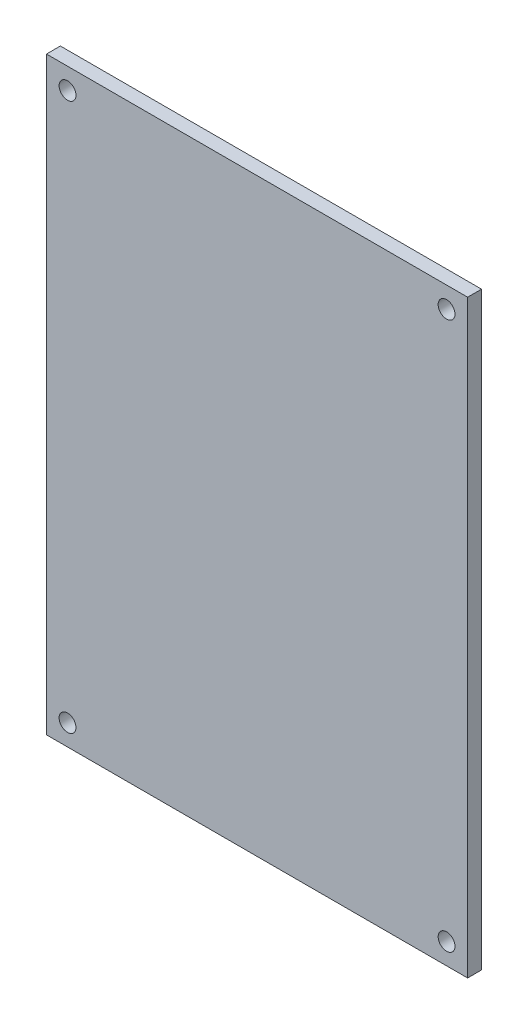
ISO-10303-21;
HEADER;
FILE_DESCRIPTION(('STEP AP214'),'2;1');
FILE_NAME('part.step','',(''),(''),'','','');
FILE_SCHEMA(('AUTOMOTIVE_DESIGN { 1 0 10303 214 1 1 1 1 }'));
ENDSEC;
DATA;
#1=APPLICATION_CONTEXT('core data for automotive mechanical design processes');
#2=APPLICATION_PROTOCOL_DEFINITION('international standard','automotive_design',2000,#1);
#3=PRODUCT_CONTEXT('',#1,'mechanical');
#4=PRODUCT('Part','Part','',(#3));
#5=PRODUCT_RELATED_PRODUCT_CATEGORY('part','',(#4));
#6=PRODUCT_DEFINITION_FORMATION('','',#4);
#7=PRODUCT_DEFINITION_CONTEXT('part definition',#1,'design');
#8=PRODUCT_DEFINITION('design','',#6,#7);
#9=PRODUCT_DEFINITION_SHAPE('','',#8);
#10=(LENGTH_UNIT() NAMED_UNIT(*) SI_UNIT(.MILLI.,.METRE.));
#11=(NAMED_UNIT(*) PLANE_ANGLE_UNIT() SI_UNIT($,.RADIAN.));
#12=(NAMED_UNIT(*) SI_UNIT($,.STERADIAN.) SOLID_ANGLE_UNIT());
#13=UNCERTAINTY_MEASURE_WITH_UNIT(LENGTH_MEASURE(1.E-05),#10,'distance_accuracy_value','');
#14=(GEOMETRIC_REPRESENTATION_CONTEXT(3) GLOBAL_UNCERTAINTY_ASSIGNED_CONTEXT((#13)) GLOBAL_UNIT_ASSIGNED_CONTEXT((#10,
#11,#12)) REPRESENTATION_CONTEXT('',''));
#15=CARTESIAN_POINT('',(0.,0.,0.));
#16=DIRECTION('',(0.,0.,1.));
#17=DIRECTION('',(1.,0.,0.));
#18=AXIS2_PLACEMENT_3D('',#15,#16,#17);
#19=CARTESIAN_POINT('',(0.,0.,1.65));
#20=DIRECTION('',(0.,0.,1.));
#21=DIRECTION('',(1.,0.,0.));
#22=AXIS2_PLACEMENT_3D('',#19,#20,#21);
#23=PLANE('',#22);
#24=CARTESIAN_POINT('',(22.5,-32.5,1.65));
#25=DIRECTION('',(0.,0.,1.));
#26=DIRECTION('',(1.,0.,0.));
#27=AXIS2_PLACEMENT_3D('',#24,#25,#26);
#28=CIRCLE('',#27,0.999999999999998);
#29=CARTESIAN_POINT('',(23.5,-32.5,1.65));
#30=VERTEX_POINT('',#29);
#31=EDGE_CURVE('E124',#30,#30,#28,.T.);
#32=ORIENTED_EDGE('',*,*,#31,.F.);
#33=EDGE_LOOP('',(#32));
#34=FACE_BOUND('',#33,.T.);
#35=CARTESIAN_POINT('',(-22.5,32.5,1.65));
#36=DIRECTION('',(0.,0.,1.));
#37=DIRECTION('',(1.,0.,0.));
#38=AXIS2_PLACEMENT_3D('',#35,#36,#37);
#39=CIRCLE('',#38,1.);
#40=CARTESIAN_POINT('',(-21.5,32.5,1.65));
#41=VERTEX_POINT('',#40);
#42=EDGE_CURVE('E103',#41,#41,#39,.T.);
#43=ORIENTED_EDGE('',*,*,#42,.F.);
#44=EDGE_LOOP('',(#43));
#45=FACE_BOUND('',#44,.T.);
#46=DIRECTION('',(0.,1.,0.));
#47=VECTOR('',#46,1.);
#48=CARTESIAN_POINT('',(25.,35.,1.65));
#49=LINE('',#48,#47);
#50=CARTESIAN_POINT('',(25.,-35.,1.65));
#51=VERTEX_POINT('',#50);
#52=CARTESIAN_POINT('',(25.,35.,1.65));
#53=VERTEX_POINT('',#52);
#54=EDGE_CURVE('E88',#51,#53,#49,.T.);
#55=ORIENTED_EDGE('',*,*,#54,.T.);
#56=DIRECTION('',(-1.,0.,0.));
#57=VECTOR('',#56,1.);
#58=CARTESIAN_POINT('',(-25.,35.,1.65));
#59=LINE('',#58,#57);
#60=CARTESIAN_POINT('',(-25.,35.,1.65));
#61=VERTEX_POINT('',#60);
#62=EDGE_CURVE('E83',#53,#61,#59,.T.);
#63=ORIENTED_EDGE('',*,*,#62,.T.);
#64=DIRECTION('',(0.,-1.,0.));
#65=VECTOR('',#64,1.);
#66=CARTESIAN_POINT('',(-25.,35.,1.65));
#67=LINE('',#66,#65);
#68=CARTESIAN_POINT('',(-25.,-35.,1.65));
#69=VERTEX_POINT('',#68);
#70=EDGE_CURVE('E86',#61,#69,#67,.T.);
#71=ORIENTED_EDGE('',*,*,#70,.T.);
#72=DIRECTION('',(1.,0.,0.));
#73=VECTOR('',#72,1.);
#74=CARTESIAN_POINT('',(-25.,-35.,1.65));
#75=LINE('',#74,#73);
#76=EDGE_CURVE('E53',#69,#51,#75,.T.);
#77=ORIENTED_EDGE('',*,*,#76,.T.);
#78=EDGE_LOOP('',(#55,#63,#71,#77));
#79=FACE_BOUND('',#78,.T.);
#80=CARTESIAN_POINT('',(22.5,32.5,1.65));
#81=DIRECTION('',(0.,0.,1.));
#82=DIRECTION('',(1.,0.,0.));
#83=AXIS2_PLACEMENT_3D('',#80,#81,#82);
#84=CIRCLE('',#83,1.);
#85=CARTESIAN_POINT('',(23.5,32.5,1.65));
#86=VERTEX_POINT('',#85);
#87=EDGE_CURVE('E118',#86,#86,#84,.T.);
#88=ORIENTED_EDGE('',*,*,#87,.F.);
#89=EDGE_LOOP('',(#88));
#90=FACE_BOUND('',#89,.T.);
#91=CARTESIAN_POINT('',(-22.5,-32.5,1.65));
#92=DIRECTION('',(0.,0.,1.));
#93=DIRECTION('',(1.,0.,0.));
#94=AXIS2_PLACEMENT_3D('',#91,#92,#93);
#95=CIRCLE('',#94,1.);
#96=CARTESIAN_POINT('',(-21.5,-32.5,1.65));
#97=VERTEX_POINT('',#96);
#98=EDGE_CURVE('E130',#97,#97,#95,.T.);
#99=ORIENTED_EDGE('',*,*,#98,.F.);
#100=EDGE_LOOP('',(#99));
#101=FACE_BOUND('',#100,.T.);
#102=ADVANCED_FACE('F36',(#34,#45,#79,#90,#101),#23,.T.);
#103=CARTESIAN_POINT('',(0.,0.,0.));
#104=DIRECTION('',(0.,0.,1.));
#105=DIRECTION('',(1.,0.,0.));
#106=AXIS2_PLACEMENT_3D('',#103,#104,#105);
#107=PLANE('',#106);
#108=DIRECTION('',(0.,1.,0.));
#109=VECTOR('',#108,1.);
#110=CARTESIAN_POINT('',(25.,35.,0.));
#111=LINE('',#110,#109);
#112=CARTESIAN_POINT('',(25.,-35.,0.));
#113=VERTEX_POINT('',#112);
#114=CARTESIAN_POINT('',(25.,35.,0.));
#115=VERTEX_POINT('',#114);
#116=EDGE_CURVE('E100',#113,#115,#111,.T.);
#117=ORIENTED_EDGE('',*,*,#116,.F.);
#118=DIRECTION('',(1.,0.,0.));
#119=VECTOR('',#118,1.);
#120=CARTESIAN_POINT('',(-25.,-35.,0.));
#121=LINE('',#120,#119);
#122=CARTESIAN_POINT('',(-25.,-35.,0.));
#123=VERTEX_POINT('',#122);
#124=EDGE_CURVE('E76',#123,#113,#121,.T.);
#125=ORIENTED_EDGE('',*,*,#124,.F.);
#126=DIRECTION('',(0.,-1.,0.));
#127=VECTOR('',#126,1.);
#128=CARTESIAN_POINT('',(-25.,35.,0.));
#129=LINE('',#128,#127);
#130=CARTESIAN_POINT('',(-25.,35.,0.));
#131=VERTEX_POINT('',#130);
#132=EDGE_CURVE('E70',#131,#123,#129,.T.);
#133=ORIENTED_EDGE('',*,*,#132,.F.);
#134=DIRECTION('',(-1.,0.,0.));
#135=VECTOR('',#134,1.);
#136=CARTESIAN_POINT('',(-25.,35.,0.));
#137=LINE('',#136,#135);
#138=EDGE_CURVE('E92',#115,#131,#137,.T.);
#139=ORIENTED_EDGE('',*,*,#138,.F.);
#140=EDGE_LOOP('',(#117,#125,#133,#139));
#141=FACE_BOUND('',#140,.T.);
#142=CARTESIAN_POINT('',(-22.5,32.5,0.));
#143=DIRECTION('',(0.,0.,1.));
#144=DIRECTION('',(1.,0.,0.));
#145=AXIS2_PLACEMENT_3D('',#142,#143,#144);
#146=CIRCLE('',#145,1.);
#147=CARTESIAN_POINT('',(-21.5,32.5,0.));
#148=VERTEX_POINT('',#147);
#149=EDGE_CURVE('E115',#148,#148,#146,.T.);
#150=ORIENTED_EDGE('',*,*,#149,.T.);
#151=EDGE_LOOP('',(#150));
#152=FACE_BOUND('',#151,.T.);
#153=CARTESIAN_POINT('',(22.5,32.5,0.));
#154=DIRECTION('',(0.,0.,1.));
#155=DIRECTION('',(1.,0.,0.));
#156=AXIS2_PLACEMENT_3D('',#153,#154,#155);
#157=CIRCLE('',#156,1.);
#158=CARTESIAN_POINT('',(23.5,32.5,0.));
#159=VERTEX_POINT('',#158);
#160=EDGE_CURVE('E121',#159,#159,#157,.T.);
#161=ORIENTED_EDGE('',*,*,#160,.T.);
#162=EDGE_LOOP('',(#161));
#163=FACE_BOUND('',#162,.T.);
#164=CARTESIAN_POINT('',(22.5,-32.5,0.));
#165=DIRECTION('',(0.,0.,1.));
#166=DIRECTION('',(1.,0.,0.));
#167=AXIS2_PLACEMENT_3D('',#164,#165,#166);
#168=CIRCLE('',#167,0.999999999999998);
#169=CARTESIAN_POINT('',(23.5,-32.5,0.));
#170=VERTEX_POINT('',#169);
#171=EDGE_CURVE('E127',#170,#170,#168,.T.);
#172=ORIENTED_EDGE('',*,*,#171,.T.);
#173=EDGE_LOOP('',(#172));
#174=FACE_BOUND('',#173,.T.);
#175=CARTESIAN_POINT('',(-22.5,-32.5,0.));
#176=DIRECTION('',(0.,0.,1.));
#177=DIRECTION('',(1.,0.,0.));
#178=AXIS2_PLACEMENT_3D('',#175,#176,#177);
#179=CIRCLE('',#178,1.);
#180=CARTESIAN_POINT('',(-21.5,-32.5,0.));
#181=VERTEX_POINT('',#180);
#182=EDGE_CURVE('E133',#181,#181,#179,.T.);
#183=ORIENTED_EDGE('',*,*,#182,.T.);
#184=EDGE_LOOP('',(#183));
#185=FACE_BOUND('',#184,.T.);
#186=ADVANCED_FACE('F111',(#141,#152,#163,#174,#185),#107,.F.);
#187=CARTESIAN_POINT('',(25.,35.,1.65));
#188=DIRECTION('',(-1.,0.,0.));
#189=DIRECTION('',(0.,-1.,0.));
#190=AXIS2_PLACEMENT_3D('',#187,#188,#189);
#191=PLANE('',#190);
#192=ORIENTED_EDGE('',*,*,#116,.T.);
#193=DIRECTION('',(0.,0.,-1.));
#194=VECTOR('',#193,1.);
#195=CARTESIAN_POINT('',(25.,35.,1.65));
#196=LINE('',#195,#194);
#197=EDGE_CURVE('E11',#53,#115,#196,.T.);
#198=ORIENTED_EDGE('',*,*,#197,.F.);
#199=ORIENTED_EDGE('',*,*,#54,.F.);
#200=DIRECTION('',(0.,0.,-1.));
#201=VECTOR('',#200,1.);
#202=CARTESIAN_POINT('',(25.,-35.,1.65));
#203=LINE('',#202,#201);
#204=EDGE_CURVE('E96',#51,#113,#203,.T.);
#205=ORIENTED_EDGE('',*,*,#204,.T.);
#206=EDGE_LOOP('',(#192,#198,#199,#205));
#207=FACE_BOUND('',#206,.T.);
#208=ADVANCED_FACE('F38',(#207),#191,.F.);
#209=CARTESIAN_POINT('',(-25.,35.,1.65));
#210=DIRECTION('',(0.,-1.,0.));
#211=DIRECTION('',(1.,0.,0.));
#212=AXIS2_PLACEMENT_3D('',#209,#210,#211);
#213=PLANE('',#212);
#214=ORIENTED_EDGE('',*,*,#138,.T.);
#215=DIRECTION('',(0.,0.,-1.));
#216=VECTOR('',#215,1.);
#217=CARTESIAN_POINT('',(-25.,35.,1.65));
#218=LINE('',#217,#216);
#219=EDGE_CURVE('E45',#61,#131,#218,.T.);
#220=ORIENTED_EDGE('',*,*,#219,.F.);
#221=ORIENTED_EDGE('',*,*,#62,.F.);
#222=ORIENTED_EDGE('',*,*,#197,.T.);
#223=EDGE_LOOP('',(#214,#220,#221,#222));
#224=FACE_BOUND('',#223,.T.);
#225=ADVANCED_FACE('F91',(#224),#213,.F.);
#226=CARTESIAN_POINT('',(-25.,35.,1.65));
#227=DIRECTION('',(1.,0.,0.));
#228=DIRECTION('',(0.,1.,0.));
#229=AXIS2_PLACEMENT_3D('',#226,#227,#228);
#230=PLANE('',#229);
#231=ORIENTED_EDGE('',*,*,#132,.T.);
#232=DIRECTION('',(0.,0.,-1.));
#233=VECTOR('',#232,1.);
#234=CARTESIAN_POINT('',(-25.,-35.,1.65));
#235=LINE('',#234,#233);
#236=EDGE_CURVE('E93',#69,#123,#235,.T.);
#237=ORIENTED_EDGE('',*,*,#236,.F.);
#238=ORIENTED_EDGE('',*,*,#70,.F.);
#239=ORIENTED_EDGE('',*,*,#219,.T.);
#240=EDGE_LOOP('',(#231,#237,#238,#239));
#241=FACE_BOUND('',#240,.T.);
#242=ADVANCED_FACE('F94',(#241),#230,.F.);
#243=CARTESIAN_POINT('',(-25.,-35.,1.65));
#244=DIRECTION('',(0.,1.,0.));
#245=DIRECTION('',(0.,0.,1.));
#246=AXIS2_PLACEMENT_3D('',#243,#244,#245);
#247=PLANE('',#246);
#248=ORIENTED_EDGE('',*,*,#124,.T.);
#249=ORIENTED_EDGE('',*,*,#204,.F.);
#250=ORIENTED_EDGE('',*,*,#76,.F.);
#251=ORIENTED_EDGE('',*,*,#236,.T.);
#252=EDGE_LOOP('',(#248,#249,#250,#251));
#253=FACE_BOUND('',#252,.T.);
#254=ADVANCED_FACE('F108',(#253),#247,.F.);
#255=CARTESIAN_POINT('',(-22.5,32.5,1.65));
#256=DIRECTION('',(0.,0.,-1.));
#257=DIRECTION('',(-1.,0.,0.));
#258=AXIS2_PLACEMENT_3D('',#255,#256,#257);
#259=CYLINDRICAL_SURFACE('',#258,1.);
#260=ORIENTED_EDGE('',*,*,#42,.T.);
#261=EDGE_LOOP('',(#260));
#262=FACE_BOUND('',#261,.T.);
#263=ORIENTED_EDGE('',*,*,#149,.F.);
#264=EDGE_LOOP('',(#263));
#265=FACE_BOUND('',#264,.T.);
#266=ADVANCED_FACE('F152',(#262,#265),#259,.F.);
#267=CARTESIAN_POINT('',(22.5,32.5,1.65));
#268=DIRECTION('',(0.,0.,-1.));
#269=DIRECTION('',(-1.,0.,0.));
#270=AXIS2_PLACEMENT_3D('',#267,#268,#269);
#271=CYLINDRICAL_SURFACE('',#270,1.);
#272=ORIENTED_EDGE('',*,*,#87,.T.);
#273=EDGE_LOOP('',(#272));
#274=FACE_BOUND('',#273,.T.);
#275=ORIENTED_EDGE('',*,*,#160,.F.);
#276=EDGE_LOOP('',(#275));
#277=FACE_BOUND('',#276,.T.);
#278=ADVANCED_FACE('F198',(#274,#277),#271,.F.);
#279=CARTESIAN_POINT('',(22.5,-32.5,1.65));
#280=DIRECTION('',(0.,0.,-1.));
#281=DIRECTION('',(-1.,0.,0.));
#282=AXIS2_PLACEMENT_3D('',#279,#280,#281);
#283=CYLINDRICAL_SURFACE('',#282,0.999999999999998);
#284=ORIENTED_EDGE('',*,*,#31,.T.);
#285=EDGE_LOOP('',(#284));
#286=FACE_BOUND('',#285,.T.);
#287=ORIENTED_EDGE('',*,*,#171,.F.);
#288=EDGE_LOOP('',(#287));
#289=FACE_BOUND('',#288,.T.);
#290=ADVANCED_FACE('F206',(#286,#289),#283,.F.);
#291=CARTESIAN_POINT('',(-22.5,-32.5,1.65));
#292=DIRECTION('',(0.,0.,-1.));
#293=DIRECTION('',(-1.,0.,0.));
#294=AXIS2_PLACEMENT_3D('',#291,#292,#293);
#295=CYLINDRICAL_SURFACE('',#294,1.);
#296=ORIENTED_EDGE('',*,*,#98,.T.);
#297=EDGE_LOOP('',(#296));
#298=FACE_BOUND('',#297,.T.);
#299=ORIENTED_EDGE('',*,*,#182,.F.);
#300=EDGE_LOOP('',(#299));
#301=FACE_BOUND('',#300,.T.);
#302=ADVANCED_FACE('F139',(#298,#301),#295,.F.);
#303=CLOSED_SHELL('',(#102,#186,#208,#225,#242,#254,#266,#278,#290,#302));
#304=MANIFOLD_SOLID_BREP('B2',#303);
#305=ADVANCED_BREP_SHAPE_REPRESENTATION('',(#18,#304),#14);
#306=SHAPE_DEFINITION_REPRESENTATION(#9,#305);
ENDSEC;
END-ISO-10303-21;
